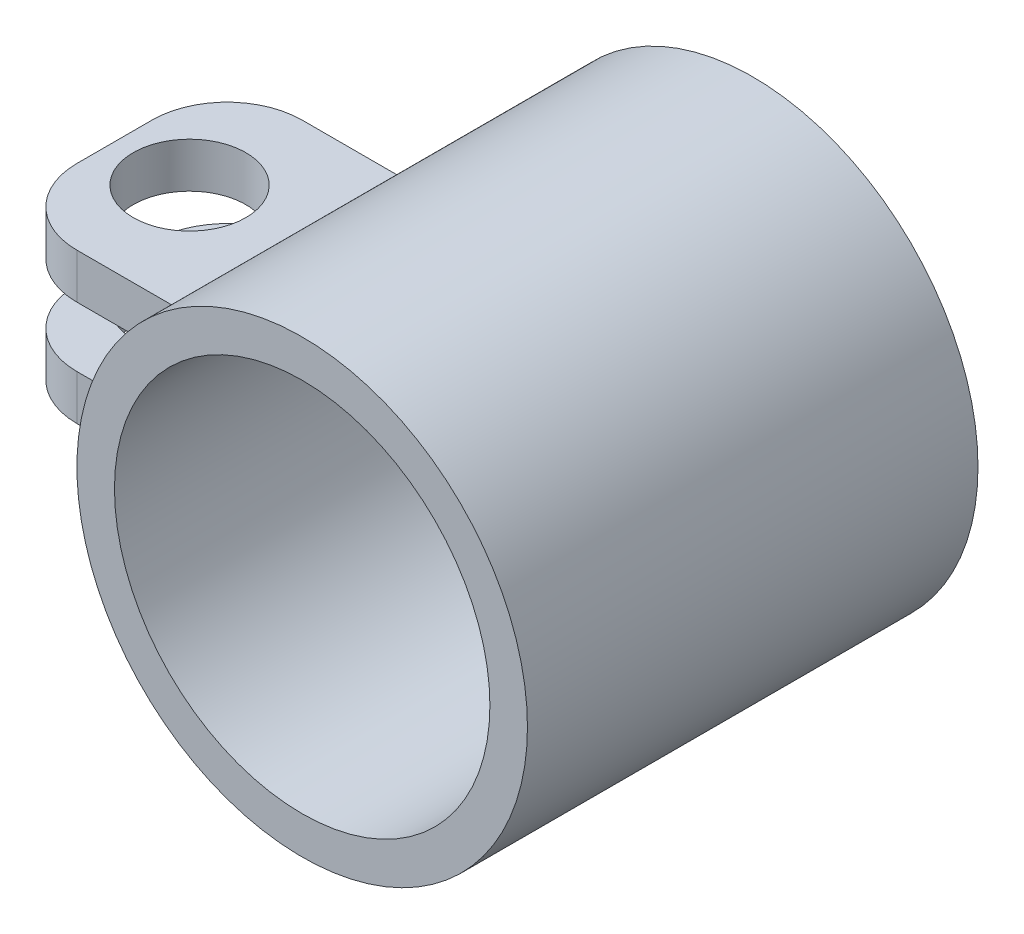
ISO-10303-21;
HEADER;
FILE_DESCRIPTION(('STEP AP214'),'2;1');
FILE_NAME('part.step','',(''),(''),'','','');
FILE_SCHEMA(('AUTOMOTIVE_DESIGN { 1 0 10303 214 1 1 1 1 }'));
ENDSEC;
DATA;
#1=APPLICATION_CONTEXT('core data for automotive mechanical design processes');
#2=APPLICATION_PROTOCOL_DEFINITION('international standard','automotive_design',2000,#1);
#3=PRODUCT_CONTEXT('',#1,'mechanical');
#4=PRODUCT('Part','Part','',(#3));
#5=PRODUCT_RELATED_PRODUCT_CATEGORY('part','',(#4));
#6=PRODUCT_DEFINITION_FORMATION('','',#4);
#7=PRODUCT_DEFINITION_CONTEXT('part definition',#1,'design');
#8=PRODUCT_DEFINITION('design','',#6,#7);
#9=PRODUCT_DEFINITION_SHAPE('','',#8);
#10=(LENGTH_UNIT() NAMED_UNIT(*) SI_UNIT(.MILLI.,.METRE.));
#11=(NAMED_UNIT(*) PLANE_ANGLE_UNIT() SI_UNIT($,.RADIAN.));
#12=(NAMED_UNIT(*) SI_UNIT($,.STERADIAN.) SOLID_ANGLE_UNIT());
#13=UNCERTAINTY_MEASURE_WITH_UNIT(LENGTH_MEASURE(1.E-05),#10,'distance_accuracy_value','');
#14=(GEOMETRIC_REPRESENTATION_CONTEXT(3) GLOBAL_UNCERTAINTY_ASSIGNED_CONTEXT((#13)) GLOBAL_UNIT_ASSIGNED_CONTEXT((#10,
#11,#12)) REPRESENTATION_CONTEXT('',''));
#15=CARTESIAN_POINT('',(0.,0.,0.));
#16=DIRECTION('',(0.,0.,1.));
#17=DIRECTION('',(1.,0.,0.));
#18=AXIS2_PLACEMENT_3D('',#15,#16,#17);
#19=CARTESIAN_POINT('',(-11.,-2.,9.));
#20=DIRECTION('',(1.,0.,0.));
#21=DIRECTION('',(0.,0.,-1.));
#22=AXIS2_PLACEMENT_3D('',#19,#20,#21);
#23=PLANE('',#22);
#24=DIRECTION('',(0.,0.,-1.));
#25=VECTOR('',#24,1.);
#26=CARTESIAN_POINT('',(-11.,0.8,27.0208242989286));
#27=LINE('',#26,#25);
#28=CARTESIAN_POINT('',(-11.,0.8,7.00000000000001));
#29=VERTEX_POINT('',#28);
#30=CARTESIAN_POINT('',(-11.,0.8,5.00000000000001));
#31=VERTEX_POINT('',#30);
#32=EDGE_CURVE('E139',#29,#31,#27,.T.);
#33=ORIENTED_EDGE('',*,*,#32,.F.);
#34=DIRECTION('',(0.,1.,0.));
#35=VECTOR('',#34,1.);
#36=CARTESIAN_POINT('',(-11.,-2.,7.));
#37=LINE('',#36,#35);
#38=CARTESIAN_POINT('',(-11.,2.,7.));
#39=VERTEX_POINT('',#38);
#40=EDGE_CURVE('E221',#29,#39,#37,.T.);
#41=ORIENTED_EDGE('',*,*,#40,.T.);
#42=DIRECTION('',(0.,0.,-1.));
#43=VECTOR('',#42,1.);
#44=CARTESIAN_POINT('',(-11.,2.,9.));
#45=LINE('',#44,#43);
#46=CARTESIAN_POINT('',(-11.,2.,5.));
#47=VERTEX_POINT('',#46);
#48=EDGE_CURVE('E151',#39,#47,#45,.T.);
#49=ORIENTED_EDGE('',*,*,#48,.T.);
#50=DIRECTION('',(0.,1.,0.));
#51=VECTOR('',#50,1.);
#52=CARTESIAN_POINT('',(-11.,-2.,5.));
#53=LINE('',#52,#51);
#54=EDGE_CURVE('E217',#47,#31,#53,.F.);
#55=ORIENTED_EDGE('',*,*,#54,.T.);
#56=EDGE_LOOP('',(#33,#41,#49,#55));
#57=FACE_BOUND('',#56,.T.);
#58=ADVANCED_FACE('F16',(#57),#23,.F.);
#59=CARTESIAN_POINT('',(-8.99999999999999,-2.,6.));
#60=DIRECTION('',(0.,1.,0.));
#61=DIRECTION('',(0.,0.,1.));
#62=AXIS2_PLACEMENT_3D('',#59,#60,#61);
#63=CYLINDRICAL_SURFACE('',#62,1.5);
#64=CARTESIAN_POINT('',(-8.99999999999999,0.799999999999999,6.));
#65=DIRECTION('',(0.,1.,0.));
#66=DIRECTION('',(0.,0.,1.));
#67=AXIS2_PLACEMENT_3D('',#64,#65,#66);
#68=CIRCLE('',#67,1.5);
#69=CARTESIAN_POINT('',(-8.99999999999999,0.799999999999999,7.5));
#70=VERTEX_POINT('',#69);
#71=EDGE_CURVE('E148',#70,#70,#68,.F.);
#72=ORIENTED_EDGE('',*,*,#71,.T.);
#73=EDGE_LOOP('',(#72));
#74=FACE_BOUND('',#73,.T.);
#75=CARTESIAN_POINT('',(-8.99999999999999,2.,6.));
#76=DIRECTION('',(0.,1.,0.));
#77=DIRECTION('',(1.,0.,0.));
#78=AXIS2_PLACEMENT_3D('',#75,#76,#77);
#79=CIRCLE('',#78,1.5);
#80=CARTESIAN_POINT('',(-7.49999999999999,2.,6.));
#81=VERTEX_POINT('',#80);
#82=EDGE_CURVE('E163',#81,#81,#79,.T.);
#83=ORIENTED_EDGE('',*,*,#82,.T.);
#84=EDGE_LOOP('',(#83));
#85=FACE_BOUND('',#84,.T.);
#86=ADVANCED_FACE('F279',(#74,#85),#63,.F.);
#87=CARTESIAN_POINT('',(0.,0.,12.));
#88=DIRECTION('',(0.,0.,-1.));
#89=DIRECTION('',(-1.,0.,0.));
#90=AXIS2_PLACEMENT_3D('',#87,#88,#89);
#91=CYLINDRICAL_SURFACE('',#90,6.);
#92=DIRECTION('',(0.,0.,-1.));
#93=VECTOR('',#92,1.);
#94=CARTESIAN_POINT('',(-5.65685424949238,-2.,12.));
#95=LINE('',#94,#93);
#96=CARTESIAN_POINT('',(-5.65685424949238,-2.,3.));
#97=VERTEX_POINT('',#96);
#98=CARTESIAN_POINT('',(-5.65685424949238,-2.,9.));
#99=VERTEX_POINT('',#98);
#100=EDGE_CURVE('E199',#97,#99,#95,.F.);
#101=ORIENTED_EDGE('',*,*,#100,.F.);
#102=CARTESIAN_POINT('',(0.,0.,3.));
#103=DIRECTION('',(0.,0.,1.));
#104=DIRECTION('',(1.,0.,0.));
#105=AXIS2_PLACEMENT_3D('',#102,#103,#104);
#106=CIRCLE('',#105,6.);
#107=CARTESIAN_POINT('',(-5.65685424949238,2.,3.));
#108=VERTEX_POINT('',#107);
#109=EDGE_CURVE('E180',#97,#108,#106,.F.);
#110=ORIENTED_EDGE('',*,*,#109,.T.);
#111=DIRECTION('',(0.,0.,-1.));
#112=VECTOR('',#111,1.);
#113=CARTESIAN_POINT('',(-5.65685424949238,2.,12.));
#114=LINE('',#113,#112);
#115=CARTESIAN_POINT('',(-5.65685424949238,2.,9.));
#116=VERTEX_POINT('',#115);
#117=EDGE_CURVE('E194',#108,#116,#114,.F.);
#118=ORIENTED_EDGE('',*,*,#117,.T.);
#119=CARTESIAN_POINT('',(0.,0.,9.));
#120=DIRECTION('',(0.,0.,-1.));
#121=DIRECTION('',(-1.,0.,0.));
#122=AXIS2_PLACEMENT_3D('',#119,#120,#121);
#123=CIRCLE('',#122,6.);
#124=EDGE_CURVE('E177',#116,#99,#123,.F.);
#125=ORIENTED_EDGE('',*,*,#124,.T.);
#126=EDGE_LOOP('',(#101,#110,#118,#125));
#127=FACE_BOUND('',#126,.T.);
#128=CARTESIAN_POINT('',(0.,0.,12.));
#129=DIRECTION('',(0.,0.,-1.));
#130=DIRECTION('',(1.,0.,0.));
#131=AXIS2_PLACEMENT_3D('',#128,#129,#130);
#132=CIRCLE('',#131,6.);
#133=CARTESIAN_POINT('',(6.,0.,12.));
#134=VERTEX_POINT('',#133);
#135=EDGE_CURVE('E191',#134,#134,#132,.T.);
#136=ORIENTED_EDGE('',*,*,#135,.T.);
#137=EDGE_LOOP('',(#136));
#138=FACE_BOUND('',#137,.T.);
#139=CARTESIAN_POINT('',(0.,0.,0.));
#140=DIRECTION('',(0.,0.,-1.));
#141=DIRECTION('',(1.,0.,0.));
#142=AXIS2_PLACEMENT_3D('',#139,#140,#141);
#143=CIRCLE('',#142,6.);
#144=CARTESIAN_POINT('',(6.,0.,0.));
#145=VERTEX_POINT('',#144);
#146=EDGE_CURVE('E187',#145,#145,#143,.T.);
#147=ORIENTED_EDGE('',*,*,#146,.F.);
#148=EDGE_LOOP('',(#147));
#149=FACE_BOUND('',#148,.T.);
#150=ADVANCED_FACE('F18',(#127,#138,#149),#91,.T.);
#151=CARTESIAN_POINT('',(0.,0.,12.));
#152=DIRECTION('',(0.,0.,-1.));
#153=DIRECTION('',(-1.,0.,0.));
#154=AXIS2_PLACEMENT_3D('',#151,#152,#153);
#155=PLANE('',#154);
#156=CARTESIAN_POINT('',(0.,0.,12.));
#157=DIRECTION('',(0.,0.,-1.));
#158=DIRECTION('',(0.,-1.,0.));
#159=AXIS2_PLACEMENT_3D('',#156,#157,#158);
#160=CIRCLE('',#159,5.);
#161=CARTESIAN_POINT('',(0.,-5.,12.));
#162=VERTEX_POINT('',#161);
#163=EDGE_CURVE('E183',#162,#162,#160,.T.);
#164=ORIENTED_EDGE('',*,*,#163,.T.);
#165=EDGE_LOOP('',(#164));
#166=FACE_BOUND('',#165,.T.);
#167=ORIENTED_EDGE('',*,*,#135,.F.);
#168=EDGE_LOOP('',(#167));
#169=FACE_BOUND('',#168,.T.);
#170=ADVANCED_FACE('F300',(#166,#169),#155,.F.);
#171=CARTESIAN_POINT('',(0.,0.,0.));
#172=DIRECTION('',(0.,0.,-1.));
#173=DIRECTION('',(-1.,0.,0.));
#174=AXIS2_PLACEMENT_3D('',#171,#172,#173);
#175=PLANE('',#174);
#176=CARTESIAN_POINT('',(0.,0.,0.));
#177=DIRECTION('',(0.,0.,-1.));
#178=DIRECTION('',(-1.,0.,0.));
#179=AXIS2_PLACEMENT_3D('',#176,#177,#178);
#180=CIRCLE('',#179,5.);
#181=CARTESIAN_POINT('',(-5.,0.,0.));
#182=VERTEX_POINT('',#181);
#183=EDGE_CURVE('E186',#182,#182,#180,.T.);
#184=ORIENTED_EDGE('',*,*,#183,.F.);
#185=EDGE_LOOP('',(#184));
#186=FACE_BOUND('',#185,.T.);
#187=ORIENTED_EDGE('',*,*,#146,.T.);
#188=EDGE_LOOP('',(#187));
#189=FACE_BOUND('',#188,.T.);
#190=ADVANCED_FACE('F295',(#186,#189),#175,.T.);
#191=CARTESIAN_POINT('',(0.,0.,12.));
#192=DIRECTION('',(0.,0.,-1.));
#193=DIRECTION('',(0.,-1.,0.));
#194=AXIS2_PLACEMENT_3D('',#191,#192,#193);
#195=CYLINDRICAL_SURFACE('',#194,5.);
#196=ORIENTED_EDGE('',*,*,#183,.T.);
#197=EDGE_LOOP('',(#196));
#198=FACE_BOUND('',#197,.T.);
#199=ORIENTED_EDGE('',*,*,#163,.F.);
#200=EDGE_LOOP('',(#199));
#201=FACE_BOUND('',#200,.T.);
#202=ADVANCED_FACE('F290',(#198,#201),#195,.F.);
#203=DIRECTION('',(0.,0.,-1.));
#204=VECTOR('',#203,1.);
#205=CARTESIAN_POINT('',(-11.,-2.,9.));
#206=LINE('',#205,#204);
#207=CARTESIAN_POINT('',(-11.,-2.,7.));
#208=VERTEX_POINT('',#207);
#209=CARTESIAN_POINT('',(-11.,-2.,5.));
#210=VERTEX_POINT('',#209);
#211=EDGE_CURVE('E168',#208,#210,#206,.T.);
#212=ORIENTED_EDGE('',*,*,#211,.F.);
#213=DIRECTION('',(0.,1.,0.));
#214=VECTOR('',#213,1.);
#215=CARTESIAN_POINT('',(-11.,-2.,7.));
#216=LINE('',#215,#214);
#217=CARTESIAN_POINT('',(-11.,-0.8,7.00000000000001));
#218=VERTEX_POINT('',#217);
#219=EDGE_CURVE('E230',#208,#218,#216,.T.);
#220=ORIENTED_EDGE('',*,*,#219,.T.);
#221=DIRECTION('',(0.,0.,-1.));
#222=VECTOR('',#221,1.);
#223=CARTESIAN_POINT('',(-11.,-0.8,27.0208242989286));
#224=LINE('',#223,#222);
#225=CARTESIAN_POINT('',(-11.,-0.8,5.00000000000001));
#226=VERTEX_POINT('',#225);
#227=EDGE_CURVE('E143',#218,#226,#224,.T.);
#228=ORIENTED_EDGE('',*,*,#227,.T.);
#229=DIRECTION('',(0.,1.,0.));
#230=VECTOR('',#229,1.);
#231=CARTESIAN_POINT('',(-11.,-2.,5.));
#232=LINE('',#231,#230);
#233=EDGE_CURVE('E207',#226,#210,#232,.F.);
#234=ORIENTED_EDGE('',*,*,#233,.T.);
#235=EDGE_LOOP('',(#212,#220,#228,#234));
#236=FACE_BOUND('',#235,.T.);
#237=ADVANCED_FACE('F236',(#236),#23,.F.);
#238=CARTESIAN_POINT('',(-11.,-2.,3.));
#239=DIRECTION('',(0.,0.,1.));
#240=DIRECTION('',(1.,0.,0.));
#241=AXIS2_PLACEMENT_3D('',#238,#239,#240);
#242=PLANE('',#241);
#243=DIRECTION('',(1.,0.,0.));
#244=VECTOR('',#243,1.);
#245=CARTESIAN_POINT('',(-11.,0.799999999999999,3.));
#246=LINE('',#245,#244);
#247=CARTESIAN_POINT('',(-9.,0.799999999999999,3.));
#248=VERTEX_POINT('',#247);
#249=CARTESIAN_POINT('',(-7.,0.799999999999999,3.));
#250=VERTEX_POINT('',#249);
#251=EDGE_CURVE('E104',#248,#250,#246,.T.);
#252=ORIENTED_EDGE('',*,*,#251,.F.);
#253=DIRECTION('',(0.,1.,0.));
#254=VECTOR('',#253,1.);
#255=CARTESIAN_POINT('',(-9.,-2.,3.));
#256=LINE('',#255,#254);
#257=CARTESIAN_POINT('',(-9.,2.,3.));
#258=VERTEX_POINT('',#257);
#259=EDGE_CURVE('E212',#248,#258,#256,.T.);
#260=ORIENTED_EDGE('',*,*,#259,.T.);
#261=DIRECTION('',(1.,0.,0.));
#262=VECTOR('',#261,1.);
#263=CARTESIAN_POINT('',(-11.,2.,3.));
#264=LINE('',#263,#262);
#265=EDGE_CURVE('E156',#258,#108,#264,.T.);
#266=ORIENTED_EDGE('',*,*,#265,.T.);
#267=ORIENTED_EDGE('',*,*,#109,.F.);
#268=DIRECTION('',(1.,0.,0.));
#269=VECTOR('',#268,1.);
#270=CARTESIAN_POINT('',(-11.,-2.,3.));
#271=LINE('',#270,#269);
#272=CARTESIAN_POINT('',(-9.,-2.,3.));
#273=VERTEX_POINT('',#272);
#274=EDGE_CURVE('E169',#273,#97,#271,.T.);
#275=ORIENTED_EDGE('',*,*,#274,.F.);
#276=DIRECTION('',(0.,1.,0.));
#277=VECTOR('',#276,1.);
#278=CARTESIAN_POINT('',(-9.,-2.,3.));
#279=LINE('',#278,#277);
#280=CARTESIAN_POINT('',(-9.,-0.8,3.));
#281=VERTEX_POINT('',#280);
#282=EDGE_CURVE('E202',#273,#281,#279,.T.);
#283=ORIENTED_EDGE('',*,*,#282,.T.);
#284=DIRECTION('',(-1.,0.,0.));
#285=VECTOR('',#284,1.);
#286=CARTESIAN_POINT('',(-7.,-0.8,3.));
#287=LINE('',#286,#285);
#288=CARTESIAN_POINT('',(-7.,-0.8,3.));
#289=VERTEX_POINT('',#288);
#290=EDGE_CURVE('E132',#289,#281,#287,.T.);
#291=ORIENTED_EDGE('',*,*,#290,.F.);
#292=DIRECTION('',(0.,-1.,0.));
#293=VECTOR('',#292,1.);
#294=CARTESIAN_POINT('',(-7.,0.799999999999999,3.));
#295=LINE('',#294,#293);
#296=EDGE_CURVE('E116',#250,#289,#295,.T.);
#297=ORIENTED_EDGE('',*,*,#296,.F.);
#298=EDGE_LOOP('',(#252,#260,#266,#267,#275,#283,#291,#297));
#299=FACE_BOUND('',#298,.T.);
#300=ADVANCED_FACE('F129',(#299),#242,.F.);
#301=CARTESIAN_POINT('',(-5.,-2.,9.));
#302=DIRECTION('',(0.,0.,-1.));
#303=DIRECTION('',(-1.,0.,0.));
#304=AXIS2_PLACEMENT_3D('',#301,#302,#303);
#305=PLANE('',#304);
#306=DIRECTION('',(-1.,0.,0.));
#307=VECTOR('',#306,1.);
#308=CARTESIAN_POINT('',(-5.,-0.8,9.));
#309=LINE('',#308,#307);
#310=CARTESIAN_POINT('',(-7.,-0.8,9.00000000000001));
#311=VERTEX_POINT('',#310);
#312=CARTESIAN_POINT('',(-9.,-0.8,9.));
#313=VERTEX_POINT('',#312);
#314=EDGE_CURVE('E146',#311,#313,#309,.T.);
#315=ORIENTED_EDGE('',*,*,#314,.T.);
#316=DIRECTION('',(0.,1.,0.));
#317=VECTOR('',#316,1.);
#318=CARTESIAN_POINT('',(-9.,-2.,9.));
#319=LINE('',#318,#317);
#320=CARTESIAN_POINT('',(-9.,-2.,9.));
#321=VERTEX_POINT('',#320);
#322=EDGE_CURVE('E24',#313,#321,#319,.F.);
#323=ORIENTED_EDGE('',*,*,#322,.T.);
#324=DIRECTION('',(-1.,0.,0.));
#325=VECTOR('',#324,1.);
#326=CARTESIAN_POINT('',(-5.,-2.,9.));
#327=LINE('',#326,#325);
#328=EDGE_CURVE('E171',#99,#321,#327,.T.);
#329=ORIENTED_EDGE('',*,*,#328,.F.);
#330=ORIENTED_EDGE('',*,*,#124,.F.);
#331=DIRECTION('',(-1.,0.,0.));
#332=VECTOR('',#331,1.);
#333=CARTESIAN_POINT('',(-5.,2.,9.));
#334=LINE('',#333,#332);
#335=CARTESIAN_POINT('',(-9.,2.,9.));
#336=VERTEX_POINT('',#335);
#337=EDGE_CURVE('E159',#116,#336,#334,.T.);
#338=ORIENTED_EDGE('',*,*,#337,.T.);
#339=DIRECTION('',(0.,1.,0.));
#340=VECTOR('',#339,1.);
#341=CARTESIAN_POINT('',(-9.,-2.,9.));
#342=LINE('',#341,#340);
#343=CARTESIAN_POINT('',(-9.,0.799999999999999,9.));
#344=VERTEX_POINT('',#343);
#345=EDGE_CURVE('E226',#336,#344,#342,.F.);
#346=ORIENTED_EDGE('',*,*,#345,.T.);
#347=DIRECTION('',(1.,0.,0.));
#348=VECTOR('',#347,1.);
#349=CARTESIAN_POINT('',(-5.,0.799999999999999,9.));
#350=LINE('',#349,#348);
#351=CARTESIAN_POINT('',(-7.,0.799999999999999,9.00000000000001));
#352=VERTEX_POINT('',#351);
#353=EDGE_CURVE('E149',#344,#352,#350,.T.);
#354=ORIENTED_EDGE('',*,*,#353,.T.);
#355=DIRECTION('',(0.,-1.,0.));
#356=VECTOR('',#355,1.);
#357=CARTESIAN_POINT('',(-7.,-2.,9.));
#358=LINE('',#357,#356);
#359=EDGE_CURVE('E125',#352,#311,#358,.T.);
#360=ORIENTED_EDGE('',*,*,#359,.T.);
#361=EDGE_LOOP('',(#315,#323,#329,#330,#338,#346,#354,#360));
#362=FACE_BOUND('',#361,.T.);
#363=ADVANCED_FACE('F256',(#362),#305,.F.);
#364=CARTESIAN_POINT('',(-8.99999999999999,-0.8,6.));
#365=DIRECTION('',(0.,-1.,0.));
#366=DIRECTION('',(0.,0.,-1.));
#367=AXIS2_PLACEMENT_3D('',#364,#365,#366);
#368=CIRCLE('',#367,1.5);
#369=CARTESIAN_POINT('',(-8.99999999999999,-0.8,4.5));
#370=VERTEX_POINT('',#369);
#371=EDGE_CURVE('E126',#370,#370,#368,.F.);
#372=ORIENTED_EDGE('',*,*,#371,.T.);
#373=EDGE_LOOP('',(#372));
#374=FACE_BOUND('',#373,.T.);
#375=CARTESIAN_POINT('',(-8.99999999999999,-2.,6.));
#376=DIRECTION('',(0.,1.,0.));
#377=DIRECTION('',(1.,0.,0.));
#378=AXIS2_PLACEMENT_3D('',#375,#376,#377);
#379=CIRCLE('',#378,1.5);
#380=CARTESIAN_POINT('',(-7.49999999999999,-2.,6.));
#381=VERTEX_POINT('',#380);
#382=EDGE_CURVE('E173',#381,#381,#379,.T.);
#383=ORIENTED_EDGE('',*,*,#382,.F.);
#384=EDGE_LOOP('',(#383));
#385=FACE_BOUND('',#384,.T.);
#386=ADVANCED_FACE('F286',(#374,#385),#63,.F.);
#387=CARTESIAN_POINT('',(-11.,-2.,3.));
#388=DIRECTION('',(0.,-1.,0.));
#389=DIRECTION('',(0.,0.,-1.));
#390=AXIS2_PLACEMENT_3D('',#387,#388,#389);
#391=PLANE('',#390);
#392=ORIENTED_EDGE('',*,*,#328,.T.);
#393=CARTESIAN_POINT('',(-9.,-2.,7.));
#394=DIRECTION('',(0.,-1.,0.));
#395=DIRECTION('',(0.,0.,-1.));
#396=AXIS2_PLACEMENT_3D('',#393,#394,#395);
#397=CIRCLE('',#396,2.);
#398=EDGE_CURVE('E10',#321,#208,#397,.T.);
#399=ORIENTED_EDGE('',*,*,#398,.T.);
#400=ORIENTED_EDGE('',*,*,#211,.T.);
#401=CARTESIAN_POINT('',(-9.,-2.,5.));
#402=DIRECTION('',(0.,-1.,0.));
#403=DIRECTION('',(0.,0.,-1.));
#404=AXIS2_PLACEMENT_3D('',#401,#402,#403);
#405=CIRCLE('',#404,2.);
#406=EDGE_CURVE('E210',#210,#273,#405,.T.);
#407=ORIENTED_EDGE('',*,*,#406,.T.);
#408=ORIENTED_EDGE('',*,*,#274,.T.);
#409=ORIENTED_EDGE('',*,*,#100,.T.);
#410=EDGE_LOOP('',(#392,#399,#400,#407,#408,#409));
#411=FACE_BOUND('',#410,.T.);
#412=ORIENTED_EDGE('',*,*,#382,.T.);
#413=EDGE_LOOP('',(#412));
#414=FACE_BOUND('',#413,.T.);
#415=ADVANCED_FACE('F247',(#411,#414),#391,.T.);
#416=CARTESIAN_POINT('',(-11.,2.,3.));
#417=DIRECTION('',(0.,-1.,0.));
#418=DIRECTION('',(0.,0.,-1.));
#419=AXIS2_PLACEMENT_3D('',#416,#417,#418);
#420=PLANE('',#419);
#421=ORIENTED_EDGE('',*,*,#48,.F.);
#422=CARTESIAN_POINT('',(-9.,2.,7.));
#423=DIRECTION('',(0.,-1.,0.));
#424=DIRECTION('',(0.,0.,-1.));
#425=AXIS2_PLACEMENT_3D('',#422,#423,#424);
#426=CIRCLE('',#425,2.);
#427=EDGE_CURVE('E224',#39,#336,#426,.F.);
#428=ORIENTED_EDGE('',*,*,#427,.T.);
#429=ORIENTED_EDGE('',*,*,#337,.F.);
#430=ORIENTED_EDGE('',*,*,#117,.F.);
#431=ORIENTED_EDGE('',*,*,#265,.F.);
#432=CARTESIAN_POINT('',(-9.,2.,5.));
#433=DIRECTION('',(0.,-1.,0.));
#434=DIRECTION('',(0.,0.,-1.));
#435=AXIS2_PLACEMENT_3D('',#432,#433,#434);
#436=CIRCLE('',#435,2.);
#437=EDGE_CURVE('E214',#258,#47,#436,.F.);
#438=ORIENTED_EDGE('',*,*,#437,.T.);
#439=EDGE_LOOP('',(#421,#428,#429,#430,#431,#438));
#440=FACE_BOUND('',#439,.T.);
#441=ORIENTED_EDGE('',*,*,#82,.F.);
#442=EDGE_LOOP('',(#441));
#443=FACE_BOUND('',#442,.T.);
#444=ADVANCED_FACE('F260',(#440,#443),#420,.F.);
#445=CARTESIAN_POINT('',(-11.,0.799999999999999,27.0208242989286));
#446=DIRECTION('',(0.,1.,0.));
#447=DIRECTION('',(0.,0.,1.));
#448=AXIS2_PLACEMENT_3D('',#445,#446,#447);
#449=PLANE('',#448);
#450=ORIENTED_EDGE('',*,*,#71,.F.);
#451=EDGE_LOOP('',(#450));
#452=FACE_BOUND('',#451,.T.);
#453=ORIENTED_EDGE('',*,*,#353,.F.);
#454=CARTESIAN_POINT('',(-9.,0.799999999999999,7.));
#455=DIRECTION('',(0.,1.,0.));
#456=DIRECTION('',(0.,0.,1.));
#457=AXIS2_PLACEMENT_3D('',#454,#455,#456);
#458=CIRCLE('',#457,2.);
#459=EDGE_CURVE('E228',#344,#29,#458,.F.);
#460=ORIENTED_EDGE('',*,*,#459,.T.);
#461=ORIENTED_EDGE('',*,*,#32,.T.);
#462=CARTESIAN_POINT('',(-9.,0.799999999999999,5.));
#463=DIRECTION('',(0.,1.,0.));
#464=DIRECTION('',(0.,0.,1.));
#465=AXIS2_PLACEMENT_3D('',#462,#463,#464);
#466=CIRCLE('',#465,2.);
#467=EDGE_CURVE('E110',#31,#248,#466,.F.);
#468=ORIENTED_EDGE('',*,*,#467,.T.);
#469=ORIENTED_EDGE('',*,*,#251,.T.);
#470=DIRECTION('',(0.,0.,-1.));
#471=VECTOR('',#470,1.);
#472=CARTESIAN_POINT('',(-7.,0.799999999999999,27.0208242989286));
#473=LINE('',#472,#471);
#474=EDGE_CURVE('E108',#352,#250,#473,.T.);
#475=ORIENTED_EDGE('',*,*,#474,.F.);
#476=EDGE_LOOP('',(#453,#460,#461,#468,#469,#475));
#477=FACE_BOUND('',#476,.T.);
#478=ADVANCED_FACE('F107',(#452,#477),#449,.F.);
#479=CARTESIAN_POINT('',(-7.,0.799999999999999,27.0208242989286));
#480=DIRECTION('',(1.,0.,0.));
#481=DIRECTION('',(0.,0.,-1.));
#482=AXIS2_PLACEMENT_3D('',#479,#480,#481);
#483=PLANE('',#482);
#484=ORIENTED_EDGE('',*,*,#474,.T.);
#485=ORIENTED_EDGE('',*,*,#296,.T.);
#486=DIRECTION('',(0.,0.,-1.));
#487=VECTOR('',#486,1.);
#488=CARTESIAN_POINT('',(-7.,-0.8,27.0208242989286));
#489=LINE('',#488,#487);
#490=EDGE_CURVE('E127',#311,#289,#489,.T.);
#491=ORIENTED_EDGE('',*,*,#490,.F.);
#492=ORIENTED_EDGE('',*,*,#359,.F.);
#493=EDGE_LOOP('',(#484,#485,#491,#492));
#494=FACE_BOUND('',#493,.T.);
#495=ADVANCED_FACE('F121',(#494),#483,.F.);
#496=CARTESIAN_POINT('',(-7.,-0.8,27.0208242989286));
#497=DIRECTION('',(0.,-1.,0.));
#498=DIRECTION('',(0.,0.,-1.));
#499=AXIS2_PLACEMENT_3D('',#496,#497,#498);
#500=PLANE('',#499);
#501=ORIENTED_EDGE('',*,*,#371,.F.);
#502=EDGE_LOOP('',(#501));
#503=FACE_BOUND('',#502,.T.);
#504=ORIENTED_EDGE('',*,*,#227,.F.);
#505=CARTESIAN_POINT('',(-9.,-0.8,7.));
#506=DIRECTION('',(0.,-1.,0.));
#507=DIRECTION('',(0.,0.,-1.));
#508=AXIS2_PLACEMENT_3D('',#505,#506,#507);
#509=CIRCLE('',#508,2.);
#510=EDGE_CURVE('E38',#218,#313,#509,.F.);
#511=ORIENTED_EDGE('',*,*,#510,.T.);
#512=ORIENTED_EDGE('',*,*,#314,.F.);
#513=ORIENTED_EDGE('',*,*,#490,.T.);
#514=ORIENTED_EDGE('',*,*,#290,.T.);
#515=CARTESIAN_POINT('',(-9.,-0.8,5.));
#516=DIRECTION('',(0.,-1.,0.));
#517=DIRECTION('',(0.,0.,-1.));
#518=AXIS2_PLACEMENT_3D('',#515,#516,#517);
#519=CIRCLE('',#518,2.);
#520=EDGE_CURVE('E204',#281,#226,#519,.F.);
#521=ORIENTED_EDGE('',*,*,#520,.T.);
#522=EDGE_LOOP('',(#504,#511,#512,#513,#514,#521));
#523=FACE_BOUND('',#522,.T.);
#524=ADVANCED_FACE('F239',(#503,#523),#500,.F.);
#525=CARTESIAN_POINT('',(-9.,-2.,5.));
#526=DIRECTION('',(0.,1.,0.));
#527=DIRECTION('',(0.,0.,1.));
#528=AXIS2_PLACEMENT_3D('',#525,#526,#527);
#529=CYLINDRICAL_SURFACE('',#528,2.);
#530=ORIENTED_EDGE('',*,*,#406,.F.);
#531=ORIENTED_EDGE('',*,*,#233,.F.);
#532=ORIENTED_EDGE('',*,*,#520,.F.);
#533=ORIENTED_EDGE('',*,*,#282,.F.);
#534=EDGE_LOOP('',(#530,#531,#532,#533));
#535=FACE_BOUND('',#534,.T.);
#536=ADVANCED_FACE('F244',(#535),#529,.T.);
#537=CARTESIAN_POINT('',(-9.,-2.,5.));
#538=DIRECTION('',(0.,1.,0.));
#539=DIRECTION('',(0.,0.,1.));
#540=AXIS2_PLACEMENT_3D('',#537,#538,#539);
#541=CYLINDRICAL_SURFACE('',#540,2.);
#542=ORIENTED_EDGE('',*,*,#467,.F.);
#543=ORIENTED_EDGE('',*,*,#54,.F.);
#544=ORIENTED_EDGE('',*,*,#437,.F.);
#545=ORIENTED_EDGE('',*,*,#259,.F.);
#546=EDGE_LOOP('',(#542,#543,#544,#545));
#547=FACE_BOUND('',#546,.T.);
#548=ADVANCED_FACE('F276',(#547),#541,.T.);
#549=CARTESIAN_POINT('',(-9.,-2.,7.));
#550=DIRECTION('',(0.,1.,0.));
#551=DIRECTION('',(0.,0.,1.));
#552=AXIS2_PLACEMENT_3D('',#549,#550,#551);
#553=CYLINDRICAL_SURFACE('',#552,2.);
#554=ORIENTED_EDGE('',*,*,#459,.F.);
#555=ORIENTED_EDGE('',*,*,#345,.F.);
#556=ORIENTED_EDGE('',*,*,#427,.F.);
#557=ORIENTED_EDGE('',*,*,#40,.F.);
#558=EDGE_LOOP('',(#554,#555,#556,#557));
#559=FACE_BOUND('',#558,.T.);
#560=ADVANCED_FACE('F265',(#559),#553,.T.);
#561=CARTESIAN_POINT('',(-9.,-2.,7.));
#562=DIRECTION('',(0.,1.,0.));
#563=DIRECTION('',(0.,0.,1.));
#564=AXIS2_PLACEMENT_3D('',#561,#562,#563);
#565=CYLINDRICAL_SURFACE('',#564,2.);
#566=ORIENTED_EDGE('',*,*,#398,.F.);
#567=ORIENTED_EDGE('',*,*,#322,.F.);
#568=ORIENTED_EDGE('',*,*,#510,.F.);
#569=ORIENTED_EDGE('',*,*,#219,.F.);
#570=EDGE_LOOP('',(#566,#567,#568,#569));
#571=FACE_BOUND('',#570,.T.);
#572=ADVANCED_FACE('F269',(#571),#565,.T.);
#573=CLOSED_SHELL('',(#58,#86,#150,#170,#190,#202,#237,#300,#363,#386,#415,#444,#478,#495,#524,
#536,#548,#560,#572));
#574=MANIFOLD_SOLID_BREP('B1',#573);
#575=ADVANCED_BREP_SHAPE_REPRESENTATION('',(#18,#574),#14);
#576=SHAPE_DEFINITION_REPRESENTATION(#9,#575);
ENDSEC;
END-ISO-10303-21;
